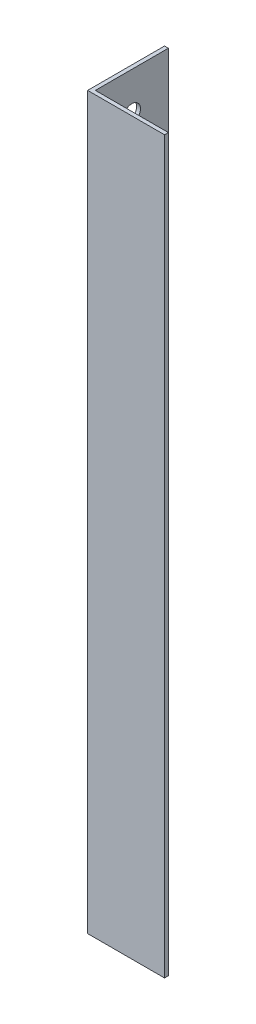
ISO-10303-21;
HEADER;
FILE_DESCRIPTION(('STEP AP214'),'2;1');
FILE_NAME('part.step','',(''),(''),'','','');
FILE_SCHEMA(('AUTOMOTIVE_DESIGN { 1 0 10303 214 1 1 1 1 }'));
ENDSEC;
DATA;
#1=APPLICATION_CONTEXT('core data for automotive mechanical design processes');
#2=APPLICATION_PROTOCOL_DEFINITION('international standard','automotive_design',2000,#1);
#3=PRODUCT_CONTEXT('',#1,'mechanical');
#4=PRODUCT('Part','Part','',(#3));
#5=PRODUCT_RELATED_PRODUCT_CATEGORY('part','',(#4));
#6=PRODUCT_DEFINITION_FORMATION('','',#4);
#7=PRODUCT_DEFINITION_CONTEXT('part definition',#1,'design');
#8=PRODUCT_DEFINITION('design','',#6,#7);
#9=PRODUCT_DEFINITION_SHAPE('','',#8);
#10=(LENGTH_UNIT() NAMED_UNIT(*) SI_UNIT(.MILLI.,.METRE.));
#11=(NAMED_UNIT(*) PLANE_ANGLE_UNIT() SI_UNIT($,.RADIAN.));
#12=(NAMED_UNIT(*) SI_UNIT($,.STERADIAN.) SOLID_ANGLE_UNIT());
#13=UNCERTAINTY_MEASURE_WITH_UNIT(LENGTH_MEASURE(1.E-05),#10,'distance_accuracy_value','');
#14=(GEOMETRIC_REPRESENTATION_CONTEXT(3) GLOBAL_UNCERTAINTY_ASSIGNED_CONTEXT((#13)) GLOBAL_UNIT_ASSIGNED_CONTEXT((#10,
#11,#12)) REPRESENTATION_CONTEXT('',''));
#15=CARTESIAN_POINT('',(0.,0.,0.));
#16=DIRECTION('',(0.,0.,1.));
#17=DIRECTION('',(1.,0.,0.));
#18=AXIS2_PLACEMENT_3D('',#15,#16,#17);
#19=CARTESIAN_POINT('',(20.,190.,0.));
#20=DIRECTION('',(0.,0.,-1.));
#21=DIRECTION('',(-1.,0.,0.));
#22=AXIS2_PLACEMENT_3D('',#19,#20,#21);
#23=PLANE('',#22);
#24=DIRECTION('',(1.,0.,0.));
#25=VECTOR('',#24,1.);
#26=CARTESIAN_POINT('',(20.,0.,0.));
#27=LINE('',#26,#25);
#28=CARTESIAN_POINT('',(0.,0.,0.));
#29=VERTEX_POINT('',#28);
#30=CARTESIAN_POINT('',(20.,0.,0.));
#31=VERTEX_POINT('',#30);
#32=EDGE_CURVE('E121',#29,#31,#27,.T.);
#33=ORIENTED_EDGE('',*,*,#32,.T.);
#34=DIRECTION('',(0.,-1.,0.));
#35=VECTOR('',#34,1.);
#36=CARTESIAN_POINT('',(20.,190.,0.));
#37=LINE('',#36,#35);
#38=CARTESIAN_POINT('',(20.,190.,0.));
#39=VERTEX_POINT('',#38);
#40=EDGE_CURVE('E11',#39,#31,#37,.T.);
#41=ORIENTED_EDGE('',*,*,#40,.F.);
#42=DIRECTION('',(1.,0.,0.));
#43=VECTOR('',#42,1.);
#44=CARTESIAN_POINT('',(20.,190.,0.));
#45=LINE('',#44,#43);
#46=CARTESIAN_POINT('',(0.,190.,0.));
#47=VERTEX_POINT('',#46);
#48=EDGE_CURVE('E132',#47,#39,#45,.T.);
#49=ORIENTED_EDGE('',*,*,#48,.F.);
#50=DIRECTION('',(0.,-1.,0.));
#51=VECTOR('',#50,1.);
#52=CARTESIAN_POINT('',(0.,190.,0.));
#53=LINE('',#52,#51);
#54=EDGE_CURVE('E117',#47,#29,#53,.T.);
#55=ORIENTED_EDGE('',*,*,#54,.T.);
#56=EDGE_LOOP('',(#33,#41,#49,#55));
#57=FACE_BOUND('',#56,.T.);
#58=ADVANCED_FACE('F37',(#57),#23,.F.);
#59=CARTESIAN_POINT('',(20.,190.,-0.999999999999998));
#60=DIRECTION('',(-1.,0.,0.));
#61=DIRECTION('',(0.,0.,1.));
#62=AXIS2_PLACEMENT_3D('',#59,#60,#61);
#63=PLANE('',#62);
#64=DIRECTION('',(0.,0.,-1.));
#65=VECTOR('',#64,1.);
#66=CARTESIAN_POINT('',(20.,0.,-0.999999999999998));
#67=LINE('',#66,#65);
#68=CARTESIAN_POINT('',(20.,0.,-0.999999999999998));
#69=VERTEX_POINT('',#68);
#70=EDGE_CURVE('E124',#31,#69,#67,.T.);
#71=ORIENTED_EDGE('',*,*,#70,.T.);
#72=DIRECTION('',(0.,-1.,0.));
#73=VECTOR('',#72,1.);
#74=CARTESIAN_POINT('',(20.,190.,-0.999999999999998));
#75=LINE('',#74,#73);
#76=CARTESIAN_POINT('',(20.,190.,-0.999999999999998));
#77=VERTEX_POINT('',#76);
#78=EDGE_CURVE('E45',#77,#69,#75,.T.);
#79=ORIENTED_EDGE('',*,*,#78,.F.);
#80=DIRECTION('',(0.,0.,-1.));
#81=VECTOR('',#80,1.);
#82=CARTESIAN_POINT('',(20.,190.,-0.999999999999998));
#83=LINE('',#82,#81);
#84=EDGE_CURVE('E90',#39,#77,#83,.T.);
#85=ORIENTED_EDGE('',*,*,#84,.F.);
#86=ORIENTED_EDGE('',*,*,#40,.T.);
#87=EDGE_LOOP('',(#71,#79,#85,#86));
#88=FACE_BOUND('',#87,.T.);
#89=ADVANCED_FACE('F161',(#88),#63,.F.);
#90=CARTESIAN_POINT('',(1.,190.,-0.999999999999997));
#91=DIRECTION('',(0.,0.,1.));
#92=DIRECTION('',(1.,0.,0.));
#93=AXIS2_PLACEMENT_3D('',#90,#91,#92);
#94=PLANE('',#93);
#95=DIRECTION('',(-1.,0.,0.));
#96=VECTOR('',#95,1.);
#97=CARTESIAN_POINT('',(1.,0.,-0.999999999999997));
#98=LINE('',#97,#96);
#99=CARTESIAN_POINT('',(1.,0.,-0.999999999999997));
#100=VERTEX_POINT('',#99);
#101=EDGE_CURVE('E127',#69,#100,#98,.T.);
#102=ORIENTED_EDGE('',*,*,#101,.T.);
#103=DIRECTION('',(0.,-1.,0.));
#104=VECTOR('',#103,1.);
#105=CARTESIAN_POINT('',(1.,190.,-0.999999999999997));
#106=LINE('',#105,#104);
#107=CARTESIAN_POINT('',(1.,190.,-0.999999999999997));
#108=VERTEX_POINT('',#107);
#109=EDGE_CURVE('E112',#108,#100,#106,.T.);
#110=ORIENTED_EDGE('',*,*,#109,.F.);
#111=DIRECTION('',(-1.,0.,0.));
#112=VECTOR('',#111,1.);
#113=CARTESIAN_POINT('',(1.,190.,-0.999999999999997));
#114=LINE('',#113,#112);
#115=EDGE_CURVE('E103',#77,#108,#114,.T.);
#116=ORIENTED_EDGE('',*,*,#115,.F.);
#117=ORIENTED_EDGE('',*,*,#78,.T.);
#118=EDGE_LOOP('',(#102,#110,#116,#117));
#119=FACE_BOUND('',#118,.T.);
#120=ADVANCED_FACE('F138',(#119),#94,.F.);
#121=CARTESIAN_POINT('',(0.999999999999998,190.,-20.));
#122=DIRECTION('',(-1.,0.,0.));
#123=DIRECTION('',(0.,0.,1.));
#124=AXIS2_PLACEMENT_3D('',#121,#122,#123);
#125=PLANE('',#124);
#126=CARTESIAN_POINT('',(0.999999999999997,159.500000000001,-10.5));
#127=DIRECTION('',(-1.,0.,0.));
#128=DIRECTION('',(0.,0.,1.));
#129=AXIS2_PLACEMENT_3D('',#126,#127,#128);
#130=CIRCLE('',#129,2.25000000000006);
#131=CARTESIAN_POINT('',(0.999999999999998,159.500000000001,-8.24999999999993));
#132=VERTEX_POINT('',#131);
#133=EDGE_CURVE('E177',#132,#132,#130,.T.);
#134=ORIENTED_EDGE('',*,*,#133,.T.);
#135=EDGE_LOOP('',(#134));
#136=FACE_BOUND('',#135,.T.);
#137=CARTESIAN_POINT('',(0.999999999999999,180.,-10.5));
#138=DIRECTION('',(1.,0.,0.));
#139=DIRECTION('',(0.,0.,-1.));
#140=AXIS2_PLACEMENT_3D('',#137,#138,#139);
#141=CIRCLE('',#140,2.25);
#142=CARTESIAN_POINT('',(0.999999999999999,180.,-12.75));
#143=VERTEX_POINT('',#142);
#144=EDGE_CURVE('E181',#143,#143,#141,.T.);
#145=ORIENTED_EDGE('',*,*,#144,.F.);
#146=EDGE_LOOP('',(#145));
#147=FACE_BOUND('',#146,.T.);
#148=CARTESIAN_POINT('',(0.999999999999999,10.,-10.5));
#149=DIRECTION('',(1.,0.,0.));
#150=DIRECTION('',(0.,0.,-1.));
#151=AXIS2_PLACEMENT_3D('',#148,#149,#150);
#152=CIRCLE('',#151,2.25);
#153=CARTESIAN_POINT('',(0.999999999999999,10.,-12.75));
#154=VERTEX_POINT('',#153);
#155=EDGE_CURVE('E184',#154,#154,#152,.T.);
#156=ORIENTED_EDGE('',*,*,#155,.F.);
#157=EDGE_LOOP('',(#156));
#158=FACE_BOUND('',#157,.T.);
#159=DIRECTION('',(0.,0.,-1.));
#160=VECTOR('',#159,1.);
#161=CARTESIAN_POINT('',(0.999999999999998,0.,-20.));
#162=LINE('',#161,#160);
#163=CARTESIAN_POINT('',(0.999999999999998,0.,-20.));
#164=VERTEX_POINT('',#163);
#165=EDGE_CURVE('E111',#100,#164,#162,.T.);
#166=ORIENTED_EDGE('',*,*,#165,.T.);
#167=DIRECTION('',(0.,-1.,0.));
#168=VECTOR('',#167,1.);
#169=CARTESIAN_POINT('',(0.999999999999998,190.,-20.));
#170=LINE('',#169,#168);
#171=CARTESIAN_POINT('',(0.999999999999998,190.,-20.));
#172=VERTEX_POINT('',#171);
#173=EDGE_CURVE('E108',#172,#164,#170,.T.);
#174=ORIENTED_EDGE('',*,*,#173,.F.);
#175=DIRECTION('',(0.,0.,-1.));
#176=VECTOR('',#175,1.);
#177=CARTESIAN_POINT('',(0.999999999999998,190.,-20.));
#178=LINE('',#177,#176);
#179=EDGE_CURVE('E97',#108,#172,#178,.T.);
#180=ORIENTED_EDGE('',*,*,#179,.F.);
#181=ORIENTED_EDGE('',*,*,#109,.T.);
#182=EDGE_LOOP('',(#166,#174,#180,#181));
#183=FACE_BOUND('',#182,.T.);
#184=ADVANCED_FACE('F109',(#136,#147,#158,#183),#125,.F.);
#185=CARTESIAN_POINT('',(0.,190.,-20.));
#186=DIRECTION('',(0.,0.,1.));
#187=DIRECTION('',(1.,0.,0.));
#188=AXIS2_PLACEMENT_3D('',#185,#186,#187);
#189=PLANE('',#188);
#190=DIRECTION('',(-1.,0.,0.));
#191=VECTOR('',#190,1.);
#192=CARTESIAN_POINT('',(0.,0.,-20.));
#193=LINE('',#192,#191);
#194=CARTESIAN_POINT('',(0.,0.,-20.));
#195=VERTEX_POINT('',#194);
#196=EDGE_CURVE('E76',#164,#195,#193,.T.);
#197=ORIENTED_EDGE('',*,*,#196,.T.);
#198=DIRECTION('',(0.,-1.,0.));
#199=VECTOR('',#198,1.);
#200=CARTESIAN_POINT('',(0.,190.,-20.));
#201=LINE('',#200,#199);
#202=CARTESIAN_POINT('',(0.,190.,-20.));
#203=VERTEX_POINT('',#202);
#204=EDGE_CURVE('E113',#203,#195,#201,.T.);
#205=ORIENTED_EDGE('',*,*,#204,.F.);
#206=DIRECTION('',(-1.,0.,0.));
#207=VECTOR('',#206,1.);
#208=CARTESIAN_POINT('',(0.,190.,-20.));
#209=LINE('',#208,#207);
#210=EDGE_CURVE('E101',#172,#203,#209,.T.);
#211=ORIENTED_EDGE('',*,*,#210,.F.);
#212=ORIENTED_EDGE('',*,*,#173,.T.);
#213=EDGE_LOOP('',(#197,#205,#211,#212));
#214=FACE_BOUND('',#213,.T.);
#215=ADVANCED_FACE('F115',(#214),#189,.F.);
#216=CARTESIAN_POINT('',(0.,190.,0.));
#217=DIRECTION('',(1.,0.,0.));
#218=DIRECTION('',(0.,0.,-1.));
#219=AXIS2_PLACEMENT_3D('',#216,#217,#218);
#220=PLANE('',#219);
#221=CARTESIAN_POINT('',(0.,159.500000000001,-10.5));
#222=DIRECTION('',(-1.,0.,0.));
#223=DIRECTION('',(0.,0.,1.));
#224=AXIS2_PLACEMENT_3D('',#221,#222,#223);
#225=CIRCLE('',#224,2.25000000000006);
#226=CARTESIAN_POINT('',(0.,159.500000000001,-8.24999999999993));
#227=VERTEX_POINT('',#226);
#228=EDGE_CURVE('E197',#227,#227,#225,.T.);
#229=ORIENTED_EDGE('',*,*,#228,.F.);
#230=EDGE_LOOP('',(#229));
#231=FACE_BOUND('',#230,.T.);
#232=CARTESIAN_POINT('',(0.,180.,-10.5));
#233=DIRECTION('',(1.,0.,0.));
#234=DIRECTION('',(0.,0.,-1.));
#235=AXIS2_PLACEMENT_3D('',#232,#233,#234);
#236=CIRCLE('',#235,2.25);
#237=CARTESIAN_POINT('',(0.,180.,-12.75));
#238=VERTEX_POINT('',#237);
#239=EDGE_CURVE('E186',#238,#238,#236,.T.);
#240=ORIENTED_EDGE('',*,*,#239,.T.);
#241=EDGE_LOOP('',(#240));
#242=FACE_BOUND('',#241,.T.);
#243=CARTESIAN_POINT('',(0.,10.,-10.5));
#244=DIRECTION('',(1.,0.,0.));
#245=DIRECTION('',(0.,0.,-1.));
#246=AXIS2_PLACEMENT_3D('',#243,#244,#245);
#247=CIRCLE('',#246,2.25);
#248=CARTESIAN_POINT('',(0.,10.,-12.75));
#249=VERTEX_POINT('',#248);
#250=EDGE_CURVE('E125',#249,#249,#247,.T.);
#251=ORIENTED_EDGE('',*,*,#250,.T.);
#252=EDGE_LOOP('',(#251));
#253=FACE_BOUND('',#252,.T.);
#254=DIRECTION('',(0.,0.,1.));
#255=VECTOR('',#254,1.);
#256=CARTESIAN_POINT('',(0.,0.,0.));
#257=LINE('',#256,#255);
#258=EDGE_CURVE('E82',#195,#29,#257,.T.);
#259=ORIENTED_EDGE('',*,*,#258,.T.);
#260=ORIENTED_EDGE('',*,*,#54,.F.);
#261=DIRECTION('',(0.,0.,1.));
#262=VECTOR('',#261,1.);
#263=CARTESIAN_POINT('',(0.,190.,0.));
#264=LINE('',#263,#262);
#265=EDGE_CURVE('E53',#203,#47,#264,.T.);
#266=ORIENTED_EDGE('',*,*,#265,.F.);
#267=ORIENTED_EDGE('',*,*,#204,.T.);
#268=EDGE_LOOP('',(#259,#260,#266,#267));
#269=FACE_BOUND('',#268,.T.);
#270=ADVANCED_FACE('F145',(#231,#242,#253,#269),#220,.F.);
#271=CARTESIAN_POINT('',(0.,190.,0.));
#272=DIRECTION('',(0.,-1.,0.));
#273=DIRECTION('',(0.,0.,-1.));
#274=AXIS2_PLACEMENT_3D('',#271,#272,#273);
#275=PLANE('',#274);
#276=ORIENTED_EDGE('',*,*,#48,.T.);
#277=ORIENTED_EDGE('',*,*,#84,.T.);
#278=ORIENTED_EDGE('',*,*,#115,.T.);
#279=ORIENTED_EDGE('',*,*,#179,.T.);
#280=ORIENTED_EDGE('',*,*,#210,.T.);
#281=ORIENTED_EDGE('',*,*,#265,.T.);
#282=EDGE_LOOP('',(#276,#277,#278,#279,#280,#281));
#283=FACE_BOUND('',#282,.T.);
#284=ADVANCED_FACE('F99',(#283),#275,.F.);
#285=CARTESIAN_POINT('',(0.,0.,0.));
#286=DIRECTION('',(0.,-1.,0.));
#287=DIRECTION('',(0.,0.,-1.));
#288=AXIS2_PLACEMENT_3D('',#285,#286,#287);
#289=PLANE('',#288);
#290=ORIENTED_EDGE('',*,*,#32,.F.);
#291=ORIENTED_EDGE('',*,*,#258,.F.);
#292=ORIENTED_EDGE('',*,*,#196,.F.);
#293=ORIENTED_EDGE('',*,*,#165,.F.);
#294=ORIENTED_EDGE('',*,*,#101,.F.);
#295=ORIENTED_EDGE('',*,*,#70,.F.);
#296=EDGE_LOOP('',(#290,#291,#292,#293,#294,#295));
#297=FACE_BOUND('',#296,.T.);
#298=ADVANCED_FACE('F141',(#297),#289,.T.);
#299=CARTESIAN_POINT('',(0.,10.,-10.5));
#300=DIRECTION('',(1.,0.,0.));
#301=DIRECTION('',(0.,0.,-1.));
#302=AXIS2_PLACEMENT_3D('',#299,#300,#301);
#303=CYLINDRICAL_SURFACE('',#302,2.25);
#304=ORIENTED_EDGE('',*,*,#250,.F.);
#305=EDGE_LOOP('',(#304));
#306=FACE_BOUND('',#305,.T.);
#307=ORIENTED_EDGE('',*,*,#155,.T.);
#308=EDGE_LOOP('',(#307));
#309=FACE_BOUND('',#308,.T.);
#310=ADVANCED_FACE('F207',(#306,#309),#303,.F.);
#311=CARTESIAN_POINT('',(0.,180.,-10.5));
#312=DIRECTION('',(1.,0.,0.));
#313=DIRECTION('',(0.,0.,-1.));
#314=AXIS2_PLACEMENT_3D('',#311,#312,#313);
#315=CYLINDRICAL_SURFACE('',#314,2.25);
#316=ORIENTED_EDGE('',*,*,#239,.F.);
#317=EDGE_LOOP('',(#316));
#318=FACE_BOUND('',#317,.T.);
#319=ORIENTED_EDGE('',*,*,#144,.T.);
#320=EDGE_LOOP('',(#319));
#321=FACE_BOUND('',#320,.T.);
#322=ADVANCED_FACE('F203',(#318,#321),#315,.F.);
#323=CARTESIAN_POINT('',(20.,159.500000000001,-10.5));
#324=DIRECTION('',(-1.,0.,0.));
#325=DIRECTION('',(0.,0.,1.));
#326=AXIS2_PLACEMENT_3D('',#323,#324,#325);
#327=CYLINDRICAL_SURFACE('',#326,2.25000000000006);
#328=ORIENTED_EDGE('',*,*,#228,.T.);
#329=EDGE_LOOP('',(#328));
#330=FACE_BOUND('',#329,.T.);
#331=ORIENTED_EDGE('',*,*,#133,.F.);
#332=EDGE_LOOP('',(#331));
#333=FACE_BOUND('',#332,.T.);
#334=ADVANCED_FACE('F200',(#330,#333),#327,.F.);
#335=CLOSED_SHELL('',(#58,#89,#120,#184,#215,#270,#284,#298,#310,#322,#334));
#336=MANIFOLD_SOLID_BREP('B2',#335);
#337=ADVANCED_BREP_SHAPE_REPRESENTATION('',(#18,#336),#14);
#338=SHAPE_DEFINITION_REPRESENTATION(#9,#337);
ENDSEC;
END-ISO-10303-21;
